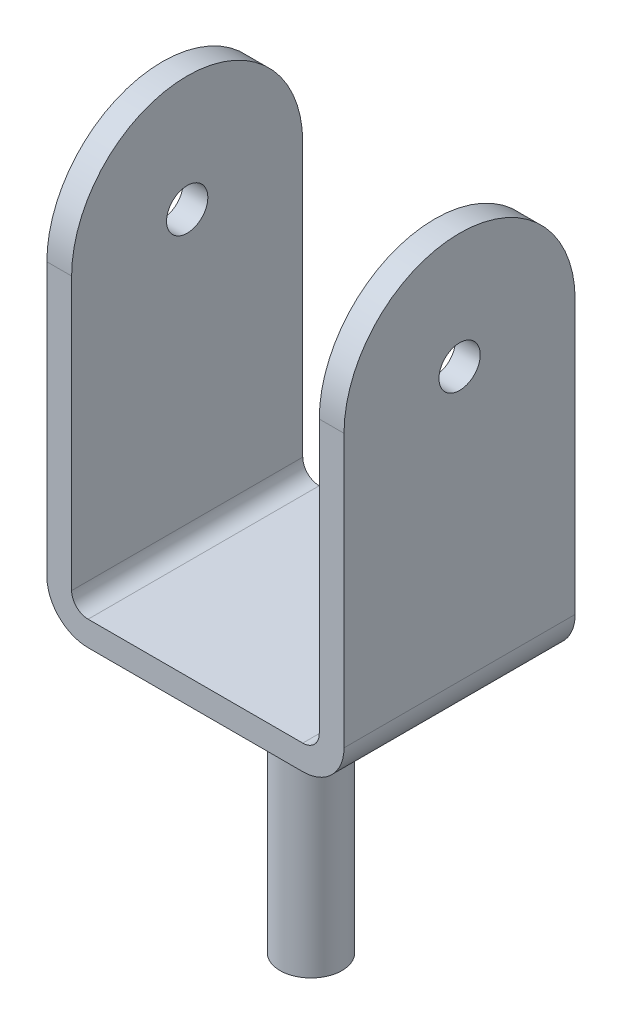
ISO-10303-21;
HEADER;
FILE_DESCRIPTION(('STEP AP214'),'2;1');
FILE_NAME('part.step','',(''),(''),'','','');
FILE_SCHEMA(('AUTOMOTIVE_DESIGN { 1 0 10303 214 1 1 1 1 }'));
ENDSEC;
DATA;
#1=APPLICATION_CONTEXT('core data for automotive mechanical design processes');
#2=APPLICATION_PROTOCOL_DEFINITION('international standard','automotive_design',2000,#1);
#3=PRODUCT_CONTEXT('',#1,'mechanical');
#4=PRODUCT('Part','Part','',(#3));
#5=PRODUCT_RELATED_PRODUCT_CATEGORY('part','',(#4));
#6=PRODUCT_DEFINITION_FORMATION('','',#4);
#7=PRODUCT_DEFINITION_CONTEXT('part definition',#1,'design');
#8=PRODUCT_DEFINITION('design','',#6,#7);
#9=PRODUCT_DEFINITION_SHAPE('','',#8);
#10=(LENGTH_UNIT() NAMED_UNIT(*) SI_UNIT(.MILLI.,.METRE.));
#11=(NAMED_UNIT(*) PLANE_ANGLE_UNIT() SI_UNIT($,.RADIAN.));
#12=(NAMED_UNIT(*) SI_UNIT($,.STERADIAN.) SOLID_ANGLE_UNIT());
#13=UNCERTAINTY_MEASURE_WITH_UNIT(LENGTH_MEASURE(1.E-05),#10,'distance_accuracy_value','');
#14=(GEOMETRIC_REPRESENTATION_CONTEXT(3) GLOBAL_UNCERTAINTY_ASSIGNED_CONTEXT((#13)) GLOBAL_UNIT_ASSIGNED_CONTEXT((#10,
#11,#12)) REPRESENTATION_CONTEXT('',''));
#15=CARTESIAN_POINT('',(0.,0.,0.));
#16=DIRECTION('',(0.,0.,1.));
#17=DIRECTION('',(1.,0.,0.));
#18=AXIS2_PLACEMENT_3D('',#15,#16,#17);
#19=CARTESIAN_POINT('',(-180.,50.,280.));
#20=DIRECTION('',(1.,0.,0.));
#21=DIRECTION('',(0.,1.,0.));
#22=AXIS2_PLACEMENT_3D('',#19,#20,#21);
#23=PLANE('',#22);
#24=CARTESIAN_POINT('',(-180.,380.,140.));
#25=DIRECTION('',(-1.,0.,0.));
#26=DIRECTION('',(0.,-1.,0.));
#27=AXIS2_PLACEMENT_3D('',#24,#25,#26);
#28=CIRCLE('',#27,140.);
#29=CARTESIAN_POINT('',(-180.,380.,0.));
#30=VERTEX_POINT('',#29);
#31=CARTESIAN_POINT('',(-180.,380.,280.));
#32=VERTEX_POINT('',#31);
#33=EDGE_CURVE('E108',#30,#32,#28,.F.);
#34=ORIENTED_EDGE('',*,*,#33,.F.);
#35=DIRECTION('',(0.,-1.,0.));
#36=VECTOR('',#35,1.);
#37=CARTESIAN_POINT('',(-180.,50.,0.));
#38=LINE('',#37,#36);
#39=CARTESIAN_POINT('',(-180.,50.,0.));
#40=VERTEX_POINT('',#39);
#41=EDGE_CURVE('E184',#30,#40,#38,.T.);
#42=ORIENTED_EDGE('',*,*,#41,.T.);
#43=DIRECTION('',(0.,0.,-1.));
#44=VECTOR('',#43,1.);
#45=CARTESIAN_POINT('',(-180.,50.,280.));
#46=LINE('',#45,#44);
#47=CARTESIAN_POINT('',(-180.,50.,280.));
#48=VERTEX_POINT('',#47);
#49=EDGE_CURVE('E255',#48,#40,#46,.T.);
#50=ORIENTED_EDGE('',*,*,#49,.F.);
#51=DIRECTION('',(0.,-1.,0.));
#52=VECTOR('',#51,1.);
#53=CARTESIAN_POINT('',(-180.,50.,280.));
#54=LINE('',#53,#52);
#55=EDGE_CURVE('E186',#32,#48,#54,.T.);
#56=ORIENTED_EDGE('',*,*,#55,.F.);
#57=EDGE_LOOP('',(#34,#42,#50,#56));
#58=FACE_BOUND('',#57,.T.);
#59=CARTESIAN_POINT('',(-180.,380.,140.));
#60=DIRECTION('',(1.,0.,0.));
#61=DIRECTION('',(0.,1.,0.));
#62=AXIS2_PLACEMENT_3D('',#59,#60,#61);
#63=CIRCLE('',#62,25.);
#64=CARTESIAN_POINT('',(-180.,405.,140.));
#65=VERTEX_POINT('',#64);
#66=EDGE_CURVE('E217',#65,#65,#63,.F.);
#67=ORIENTED_EDGE('',*,*,#66,.F.);
#68=EDGE_LOOP('',(#67));
#69=FACE_BOUND('',#68,.T.);
#70=ADVANCED_FACE('F91',(#58,#69),#23,.F.);
#71=CARTESIAN_POINT('',(180.,50.,280.));
#72=DIRECTION('',(-1.,0.,0.));
#73=DIRECTION('',(0.,-1.,0.));
#74=AXIS2_PLACEMENT_3D('',#71,#72,#73);
#75=PLANE('',#74);
#76=CARTESIAN_POINT('',(180.,380.,140.));
#77=DIRECTION('',(-1.,0.,0.));
#78=DIRECTION('',(0.,-1.,0.));
#79=AXIS2_PLACEMENT_3D('',#76,#77,#78);
#80=CIRCLE('',#79,25.);
#81=CARTESIAN_POINT('',(180.,355.,140.));
#82=VERTEX_POINT('',#81);
#83=EDGE_CURVE('E189',#82,#82,#80,.F.);
#84=ORIENTED_EDGE('',*,*,#83,.F.);
#85=EDGE_LOOP('',(#84));
#86=FACE_BOUND('',#85,.T.);
#87=DIRECTION('',(0.,1.,0.));
#88=VECTOR('',#87,1.);
#89=CARTESIAN_POINT('',(180.,50.,0.));
#90=LINE('',#89,#88);
#91=CARTESIAN_POINT('',(180.,50.,0.));
#92=VERTEX_POINT('',#91);
#93=CARTESIAN_POINT('',(180.,380.,0.));
#94=VERTEX_POINT('',#93);
#95=EDGE_CURVE('E269',#92,#94,#90,.T.);
#96=ORIENTED_EDGE('',*,*,#95,.T.);
#97=CARTESIAN_POINT('',(180.,380.,140.));
#98=DIRECTION('',(-1.,0.,0.));
#99=DIRECTION('',(0.,-1.,0.));
#100=AXIS2_PLACEMENT_3D('',#97,#98,#99);
#101=CIRCLE('',#100,140.);
#102=CARTESIAN_POINT('',(180.,380.,280.));
#103=VERTEX_POINT('',#102);
#104=EDGE_CURVE('E177',#94,#103,#101,.F.);
#105=ORIENTED_EDGE('',*,*,#104,.T.);
#106=DIRECTION('',(0.,1.,0.));
#107=VECTOR('',#106,1.);
#108=CARTESIAN_POINT('',(180.,50.,280.));
#109=LINE('',#108,#107);
#110=CARTESIAN_POINT('',(180.,50.,280.));
#111=VERTEX_POINT('',#110);
#112=EDGE_CURVE('E299',#111,#103,#109,.T.);
#113=ORIENTED_EDGE('',*,*,#112,.F.);
#114=DIRECTION('',(0.,0.,-1.));
#115=VECTOR('',#114,1.);
#116=CARTESIAN_POINT('',(180.,50.,280.));
#117=LINE('',#116,#115);
#118=EDGE_CURVE('E236',#111,#92,#117,.T.);
#119=ORIENTED_EDGE('',*,*,#118,.T.);
#120=EDGE_LOOP('',(#96,#105,#113,#119));
#121=FACE_BOUND('',#120,.T.);
#122=ADVANCED_FACE('F350',(#86,#121),#75,.F.);
#123=CARTESIAN_POINT('',(150.,520.,280.));
#124=DIRECTION('',(1.,0.,0.));
#125=DIRECTION('',(0.,1.,0.));
#126=AXIS2_PLACEMENT_3D('',#123,#124,#125);
#127=PLANE('',#126);
#128=CARTESIAN_POINT('',(150.,380.,140.));
#129=DIRECTION('',(1.,0.,0.));
#130=DIRECTION('',(0.,1.,0.));
#131=AXIS2_PLACEMENT_3D('',#128,#129,#130);
#132=CIRCLE('',#131,25.);
#133=CARTESIAN_POINT('',(150.,405.,140.));
#134=VERTEX_POINT('',#133);
#135=EDGE_CURVE('E318',#134,#134,#132,.F.);
#136=ORIENTED_EDGE('',*,*,#135,.F.);
#137=EDGE_LOOP('',(#136));
#138=FACE_BOUND('',#137,.T.);
#139=CARTESIAN_POINT('',(150.,380.,140.));
#140=DIRECTION('',(1.,0.,0.));
#141=DIRECTION('',(0.,1.,0.));
#142=AXIS2_PLACEMENT_3D('',#139,#140,#141);
#143=CIRCLE('',#142,140.);
#144=CARTESIAN_POINT('',(150.,380.,280.));
#145=VERTEX_POINT('',#144);
#146=CARTESIAN_POINT('',(150.,380.,0.));
#147=VERTEX_POINT('',#146);
#148=EDGE_CURVE('E310',#145,#147,#143,.F.);
#149=ORIENTED_EDGE('',*,*,#148,.T.);
#150=DIRECTION('',(0.,-1.,0.));
#151=VECTOR('',#150,1.);
#152=CARTESIAN_POINT('',(150.,520.,0.));
#153=LINE('',#152,#151);
#154=CARTESIAN_POINT('',(150.,50.,0.));
#155=VERTEX_POINT('',#154);
#156=EDGE_CURVE('E266',#147,#155,#153,.T.);
#157=ORIENTED_EDGE('',*,*,#156,.T.);
#158=DIRECTION('',(0.,0.,-1.));
#159=VECTOR('',#158,1.);
#160=CARTESIAN_POINT('',(150.,50.,280.));
#161=LINE('',#160,#159);
#162=CARTESIAN_POINT('',(150.,50.,280.));
#163=VERTEX_POINT('',#162);
#164=EDGE_CURVE('E240',#163,#155,#161,.T.);
#165=ORIENTED_EDGE('',*,*,#164,.F.);
#166=DIRECTION('',(0.,-1.,0.));
#167=VECTOR('',#166,1.);
#168=CARTESIAN_POINT('',(150.,520.,280.));
#169=LINE('',#168,#167);
#170=EDGE_CURVE('E296',#145,#163,#169,.T.);
#171=ORIENTED_EDGE('',*,*,#170,.F.);
#172=EDGE_LOOP('',(#149,#157,#165,#171));
#173=FACE_BOUND('',#172,.T.);
#174=ADVANCED_FACE('F366',(#138,#173),#127,.F.);
#175=CARTESIAN_POINT('',(-150.,520.,280.));
#176=DIRECTION('',(-1.,0.,0.));
#177=DIRECTION('',(0.,-1.,0.));
#178=AXIS2_PLACEMENT_3D('',#175,#176,#177);
#179=PLANE('',#178);
#180=CARTESIAN_POINT('',(-150.,380.,140.));
#181=DIRECTION('',(-1.,0.,0.));
#182=DIRECTION('',(0.,-1.,0.));
#183=AXIS2_PLACEMENT_3D('',#180,#181,#182);
#184=CIRCLE('',#183,25.);
#185=CARTESIAN_POINT('',(-150.,355.,140.));
#186=VERTEX_POINT('',#185);
#187=EDGE_CURVE('E220',#186,#186,#184,.F.);
#188=ORIENTED_EDGE('',*,*,#187,.F.);
#189=EDGE_LOOP('',(#188));
#190=FACE_BOUND('',#189,.T.);
#191=DIRECTION('',(0.,1.,0.));
#192=VECTOR('',#191,1.);
#193=CARTESIAN_POINT('',(-150.,520.,0.));
#194=LINE('',#193,#192);
#195=CARTESIAN_POINT('',(-150.,50.,0.));
#196=VERTEX_POINT('',#195);
#197=CARTESIAN_POINT('',(-150.,380.,0.));
#198=VERTEX_POINT('',#197);
#199=EDGE_CURVE('E205',#196,#198,#194,.T.);
#200=ORIENTED_EDGE('',*,*,#199,.T.);
#201=CARTESIAN_POINT('',(-150.,380.,140.));
#202=DIRECTION('',(-1.,0.,0.));
#203=DIRECTION('',(0.,-1.,0.));
#204=AXIS2_PLACEMENT_3D('',#201,#202,#203);
#205=CIRCLE('',#204,140.);
#206=CARTESIAN_POINT('',(-150.,380.,280.));
#207=VERTEX_POINT('',#206);
#208=EDGE_CURVE('E188',#198,#207,#205,.F.);
#209=ORIENTED_EDGE('',*,*,#208,.T.);
#210=DIRECTION('',(0.,1.,0.));
#211=VECTOR('',#210,1.);
#212=CARTESIAN_POINT('',(-150.,520.,280.));
#213=LINE('',#212,#211);
#214=CARTESIAN_POINT('',(-150.,50.,280.));
#215=VERTEX_POINT('',#214);
#216=EDGE_CURVE('E283',#215,#207,#213,.T.);
#217=ORIENTED_EDGE('',*,*,#216,.F.);
#218=DIRECTION('',(0.,0.,-1.));
#219=VECTOR('',#218,1.);
#220=CARTESIAN_POINT('',(-150.,50.,280.));
#221=LINE('',#220,#219);
#222=EDGE_CURVE('E251',#215,#196,#221,.T.);
#223=ORIENTED_EDGE('',*,*,#222,.T.);
#224=EDGE_LOOP('',(#200,#209,#217,#223));
#225=FACE_BOUND('',#224,.T.);
#226=ADVANCED_FACE('F371',(#190,#225),#179,.F.);
#227=CARTESIAN_POINT('',(-130.,50.,0.));
#228=DIRECTION('',(0.,0.,-1.));
#229=DIRECTION('',(-1.,0.,0.));
#230=AXIS2_PLACEMENT_3D('',#227,#228,#229);
#231=PLANE('',#230);
#232=ORIENTED_EDGE('',*,*,#41,.F.);
#233=DIRECTION('',(-1.,0.,0.));
#234=VECTOR('',#233,1.);
#235=CARTESIAN_POINT('',(219.,380.,0.));
#236=LINE('',#235,#234);
#237=EDGE_CURVE('E101',#30,#198,#236,.F.);
#238=ORIENTED_EDGE('',*,*,#237,.T.);
#239=ORIENTED_EDGE('',*,*,#199,.F.);
#240=CARTESIAN_POINT('',(-130.,50.,0.));
#241=DIRECTION('',(0.,0.,-1.));
#242=DIRECTION('',(1.,0.,0.));
#243=AXIS2_PLACEMENT_3D('',#240,#241,#242);
#244=CIRCLE('',#243,20.);
#245=CARTESIAN_POINT('',(-130.,30.,0.));
#246=VERTEX_POINT('',#245);
#247=EDGE_CURVE('E214',#246,#196,#244,.T.);
#248=ORIENTED_EDGE('',*,*,#247,.F.);
#249=DIRECTION('',(-1.,0.,0.));
#250=VECTOR('',#249,1.);
#251=CARTESIAN_POINT('',(-130.,30.,0.));
#252=LINE('',#251,#250);
#253=CARTESIAN_POINT('',(130.,30.,0.));
#254=VERTEX_POINT('',#253);
#255=EDGE_CURVE('E260',#254,#246,#252,.T.);
#256=ORIENTED_EDGE('',*,*,#255,.F.);
#257=CARTESIAN_POINT('',(130.,50.,0.));
#258=DIRECTION('',(0.,0.,-1.));
#259=DIRECTION('',(-1.,0.,0.));
#260=AXIS2_PLACEMENT_3D('',#257,#258,#259);
#261=CIRCLE('',#260,20.);
#262=EDGE_CURVE('E263',#155,#254,#261,.T.);
#263=ORIENTED_EDGE('',*,*,#262,.F.);
#264=ORIENTED_EDGE('',*,*,#156,.F.);
#265=EDGE_CURVE('E197',#147,#94,#236,.F.);
#266=ORIENTED_EDGE('',*,*,#265,.T.);
#267=ORIENTED_EDGE('',*,*,#95,.F.);
#268=CARTESIAN_POINT('',(130.,50.,0.));
#269=DIRECTION('',(0.,0.,1.));
#270=DIRECTION('',(1.,0.,0.));
#271=AXIS2_PLACEMENT_3D('',#268,#269,#270);
#272=CIRCLE('',#271,50.);
#273=CARTESIAN_POINT('',(130.,0.,0.));
#274=VERTEX_POINT('',#273);
#275=EDGE_CURVE('E273',#274,#92,#272,.T.);
#276=ORIENTED_EDGE('',*,*,#275,.F.);
#277=DIRECTION('',(1.,0.,0.));
#278=VECTOR('',#277,1.);
#279=CARTESIAN_POINT('',(-130.,0.,0.));
#280=LINE('',#279,#278);
#281=CARTESIAN_POINT('',(-130.,0.,0.));
#282=VERTEX_POINT('',#281);
#283=EDGE_CURVE('E276',#282,#274,#280,.T.);
#284=ORIENTED_EDGE('',*,*,#283,.F.);
#285=CARTESIAN_POINT('',(-130.,50.,0.));
#286=DIRECTION('',(0.,0.,1.));
#287=DIRECTION('',(-1.,0.,0.));
#288=AXIS2_PLACEMENT_3D('',#285,#286,#287);
#289=CIRCLE('',#288,50.);
#290=EDGE_CURVE('E202',#40,#282,#289,.T.);
#291=ORIENTED_EDGE('',*,*,#290,.F.);
#292=EDGE_LOOP('',(#232,#238,#239,#248,#256,#263,#264,#266,#267,#276,#284,#291));
#293=FACE_BOUND('',#292,.T.);
#294=ADVANCED_FACE('F200',(#293),#231,.T.);
#295=CARTESIAN_POINT('',(-130.,50.,280.));
#296=DIRECTION('',(0.,0.,-1.));
#297=DIRECTION('',(-1.,0.,0.));
#298=AXIS2_PLACEMENT_3D('',#295,#296,#297);
#299=PLANE('',#298);
#300=DIRECTION('',(-1.,0.,0.));
#301=VECTOR('',#300,1.);
#302=CARTESIAN_POINT('',(219.,380.,280.));
#303=LINE('',#302,#301);
#304=EDGE_CURVE('E224',#32,#207,#303,.F.);
#305=ORIENTED_EDGE('',*,*,#304,.F.);
#306=ORIENTED_EDGE('',*,*,#55,.T.);
#307=CARTESIAN_POINT('',(-130.,50.,280.));
#308=DIRECTION('',(0.,0.,1.));
#309=DIRECTION('',(-1.,0.,0.));
#310=AXIS2_PLACEMENT_3D('',#307,#308,#309);
#311=CIRCLE('',#310,50.);
#312=CARTESIAN_POINT('',(-130.,0.,280.));
#313=VERTEX_POINT('',#312);
#314=EDGE_CURVE('E204',#48,#313,#311,.T.);
#315=ORIENTED_EDGE('',*,*,#314,.T.);
#316=DIRECTION('',(1.,0.,0.));
#317=VECTOR('',#316,1.);
#318=CARTESIAN_POINT('',(-130.,0.,280.));
#319=LINE('',#318,#317);
#320=CARTESIAN_POINT('',(130.,0.,280.));
#321=VERTEX_POINT('',#320);
#322=EDGE_CURVE('E211',#313,#321,#319,.T.);
#323=ORIENTED_EDGE('',*,*,#322,.T.);
#324=CARTESIAN_POINT('',(130.,50.,280.));
#325=DIRECTION('',(0.,0.,1.));
#326=DIRECTION('',(1.,0.,0.));
#327=AXIS2_PLACEMENT_3D('',#324,#325,#326);
#328=CIRCLE('',#327,50.);
#329=EDGE_CURVE('E303',#321,#111,#328,.T.);
#330=ORIENTED_EDGE('',*,*,#329,.T.);
#331=ORIENTED_EDGE('',*,*,#112,.T.);
#332=EDGE_CURVE('E225',#145,#103,#303,.F.);
#333=ORIENTED_EDGE('',*,*,#332,.F.);
#334=ORIENTED_EDGE('',*,*,#170,.T.);
#335=CARTESIAN_POINT('',(130.,50.,280.));
#336=DIRECTION('',(0.,0.,-1.));
#337=DIRECTION('',(-1.,0.,0.));
#338=AXIS2_PLACEMENT_3D('',#335,#336,#337);
#339=CIRCLE('',#338,20.);
#340=CARTESIAN_POINT('',(130.,30.,280.));
#341=VERTEX_POINT('',#340);
#342=EDGE_CURVE('E293',#163,#341,#339,.T.);
#343=ORIENTED_EDGE('',*,*,#342,.T.);
#344=DIRECTION('',(-1.,0.,0.));
#345=VECTOR('',#344,1.);
#346=CARTESIAN_POINT('',(-130.,30.,280.));
#347=LINE('',#346,#345);
#348=CARTESIAN_POINT('',(-130.,30.,280.));
#349=VERTEX_POINT('',#348);
#350=EDGE_CURVE('E290',#341,#349,#347,.T.);
#351=ORIENTED_EDGE('',*,*,#350,.T.);
#352=CARTESIAN_POINT('',(-130.,50.,280.));
#353=DIRECTION('',(0.,0.,-1.));
#354=DIRECTION('',(1.,0.,0.));
#355=AXIS2_PLACEMENT_3D('',#352,#353,#354);
#356=CIRCLE('',#355,20.);
#357=EDGE_CURVE('E287',#349,#215,#356,.T.);
#358=ORIENTED_EDGE('',*,*,#357,.T.);
#359=ORIENTED_EDGE('',*,*,#216,.T.);
#360=EDGE_LOOP('',(#305,#306,#315,#323,#330,#331,#333,#334,#343,#351,#358,#359));
#361=FACE_BOUND('',#360,.T.);
#362=ADVANCED_FACE('F354',(#361),#299,.F.);
#363=CARTESIAN_POINT('',(-130.,50.,280.));
#364=DIRECTION('',(0.,0.,-1.));
#365=DIRECTION('',(-1.,0.,0.));
#366=AXIS2_PLACEMENT_3D('',#363,#364,#365);
#367=CYLINDRICAL_SURFACE('',#366,50.);
#368=ORIENTED_EDGE('',*,*,#290,.T.);
#369=DIRECTION('',(0.,0.,-1.));
#370=VECTOR('',#369,1.);
#371=CARTESIAN_POINT('',(-130.,0.,280.));
#372=LINE('',#371,#370);
#373=EDGE_CURVE('E228',#313,#282,#372,.T.);
#374=ORIENTED_EDGE('',*,*,#373,.F.);
#375=ORIENTED_EDGE('',*,*,#314,.F.);
#376=ORIENTED_EDGE('',*,*,#49,.T.);
#377=EDGE_LOOP('',(#368,#374,#375,#376));
#378=FACE_BOUND('',#377,.T.);
#379=ADVANCED_FACE('F93',(#378),#367,.T.);
#380=CARTESIAN_POINT('',(-130.,0.,280.));
#381=DIRECTION('',(0.,1.,0.));
#382=DIRECTION('',(0.,0.,1.));
#383=AXIS2_PLACEMENT_3D('',#380,#381,#382);
#384=PLANE('',#383);
#385=CARTESIAN_POINT('',(0.,0.,140.));
#386=DIRECTION('',(0.,1.,0.));
#387=DIRECTION('',(0.,0.,1.));
#388=AXIS2_PLACEMENT_3D('',#385,#386,#387);
#389=CIRCLE('',#388,37.5);
#390=CARTESIAN_POINT('',(0.,0.,177.5));
#391=VERTEX_POINT('',#390);
#392=EDGE_CURVE('E12',#391,#391,#389,.F.);
#393=ORIENTED_EDGE('',*,*,#392,.F.);
#394=EDGE_LOOP('',(#393));
#395=FACE_BOUND('',#394,.T.);
#396=ORIENTED_EDGE('',*,*,#283,.T.);
#397=DIRECTION('',(0.,0.,-1.));
#398=VECTOR('',#397,1.);
#399=CARTESIAN_POINT('',(130.,0.,280.));
#400=LINE('',#399,#398);
#401=EDGE_CURVE('E232',#321,#274,#400,.T.);
#402=ORIENTED_EDGE('',*,*,#401,.F.);
#403=ORIENTED_EDGE('',*,*,#322,.F.);
#404=ORIENTED_EDGE('',*,*,#373,.T.);
#405=EDGE_LOOP('',(#396,#402,#403,#404));
#406=FACE_BOUND('',#405,.T.);
#407=ADVANCED_FACE('F337',(#395,#406),#384,.F.);
#408=CARTESIAN_POINT('',(130.,50.,280.));
#409=DIRECTION('',(0.,0.,-1.));
#410=DIRECTION('',(-1.,0.,0.));
#411=AXIS2_PLACEMENT_3D('',#408,#409,#410);
#412=CYLINDRICAL_SURFACE('',#411,50.);
#413=ORIENTED_EDGE('',*,*,#275,.T.);
#414=ORIENTED_EDGE('',*,*,#118,.F.);
#415=ORIENTED_EDGE('',*,*,#329,.F.);
#416=ORIENTED_EDGE('',*,*,#401,.T.);
#417=EDGE_LOOP('',(#413,#414,#415,#416));
#418=FACE_BOUND('',#417,.T.);
#419=ADVANCED_FACE('F340',(#418),#412,.T.);
#420=CARTESIAN_POINT('',(130.,50.,280.));
#421=DIRECTION('',(0.,0.,-1.));
#422=DIRECTION('',(-1.,0.,0.));
#423=AXIS2_PLACEMENT_3D('',#420,#421,#422);
#424=CYLINDRICAL_SURFACE('',#423,20.);
#425=ORIENTED_EDGE('',*,*,#262,.T.);
#426=DIRECTION('',(0.,0.,-1.));
#427=VECTOR('',#426,1.);
#428=CARTESIAN_POINT('',(130.,30.,280.));
#429=LINE('',#428,#427);
#430=EDGE_CURVE('E244',#341,#254,#429,.T.);
#431=ORIENTED_EDGE('',*,*,#430,.F.);
#432=ORIENTED_EDGE('',*,*,#342,.F.);
#433=ORIENTED_EDGE('',*,*,#164,.T.);
#434=EDGE_LOOP('',(#425,#431,#432,#433));
#435=FACE_BOUND('',#434,.T.);
#436=ADVANCED_FACE('F383',(#435),#424,.F.);
#437=CARTESIAN_POINT('',(-130.,30.,280.));
#438=DIRECTION('',(0.,-1.,0.));
#439=DIRECTION('',(0.,0.,-1.));
#440=AXIS2_PLACEMENT_3D('',#437,#438,#439);
#441=PLANE('',#440);
#442=ORIENTED_EDGE('',*,*,#255,.T.);
#443=DIRECTION('',(0.,0.,-1.));
#444=VECTOR('',#443,1.);
#445=CARTESIAN_POINT('',(-130.,30.,280.));
#446=LINE('',#445,#444);
#447=EDGE_CURVE('E247',#349,#246,#446,.T.);
#448=ORIENTED_EDGE('',*,*,#447,.F.);
#449=ORIENTED_EDGE('',*,*,#350,.F.);
#450=ORIENTED_EDGE('',*,*,#430,.T.);
#451=EDGE_LOOP('',(#442,#448,#449,#450));
#452=FACE_BOUND('',#451,.T.);
#453=ADVANCED_FACE('F379',(#452),#441,.F.);
#454=CARTESIAN_POINT('',(-130.,50.,280.));
#455=DIRECTION('',(0.,0.,-1.));
#456=DIRECTION('',(-1.,0.,0.));
#457=AXIS2_PLACEMENT_3D('',#454,#455,#456);
#458=CYLINDRICAL_SURFACE('',#457,20.);
#459=ORIENTED_EDGE('',*,*,#247,.T.);
#460=ORIENTED_EDGE('',*,*,#222,.F.);
#461=ORIENTED_EDGE('',*,*,#357,.F.);
#462=ORIENTED_EDGE('',*,*,#447,.T.);
#463=EDGE_LOOP('',(#459,#460,#461,#462));
#464=FACE_BOUND('',#463,.T.);
#465=ADVANCED_FACE('F375',(#464),#458,.F.);
#466=CARTESIAN_POINT('',(219.,380.,140.));
#467=DIRECTION('',(-1.,0.,0.));
#468=DIRECTION('',(0.,-1.,0.));
#469=AXIS2_PLACEMENT_3D('',#466,#467,#468);
#470=CYLINDRICAL_SURFACE('',#469,140.);
#471=ORIENTED_EDGE('',*,*,#104,.F.);
#472=ORIENTED_EDGE('',*,*,#265,.F.);
#473=ORIENTED_EDGE('',*,*,#148,.F.);
#474=ORIENTED_EDGE('',*,*,#332,.T.);
#475=EDGE_LOOP('',(#471,#472,#473,#474));
#476=FACE_BOUND('',#475,.T.);
#477=ADVANCED_FACE('F378',(#476),#470,.T.);
#478=ORIENTED_EDGE('',*,*,#208,.F.);
#479=ORIENTED_EDGE('',*,*,#237,.F.);
#480=ORIENTED_EDGE('',*,*,#33,.T.);
#481=ORIENTED_EDGE('',*,*,#304,.T.);
#482=EDGE_LOOP('',(#478,#479,#480,#481));
#483=FACE_BOUND('',#482,.T.);
#484=ADVANCED_FACE('F191',(#483),#470,.T.);
#485=CARTESIAN_POINT('',(-180.000012,380.,140.));
#486=DIRECTION('',(1.,0.,0.));
#487=DIRECTION('',(0.,1.,0.));
#488=AXIS2_PLACEMENT_3D('',#485,#486,#487);
#489=CYLINDRICAL_SURFACE('',#488,25.);
#490=ORIENTED_EDGE('',*,*,#66,.T.);
#491=EDGE_LOOP('',(#490));
#492=FACE_BOUND('',#491,.T.);
#493=ORIENTED_EDGE('',*,*,#187,.T.);
#494=EDGE_LOOP('',(#493));
#495=FACE_BOUND('',#494,.T.);
#496=ADVANCED_FACE('F414',(#492,#495),#489,.F.);
#497=ORIENTED_EDGE('',*,*,#135,.T.);
#498=EDGE_LOOP('',(#497));
#499=FACE_BOUND('',#498,.T.);
#500=ORIENTED_EDGE('',*,*,#83,.T.);
#501=EDGE_LOOP('',(#500));
#502=FACE_BOUND('',#501,.T.);
#503=ADVANCED_FACE('F333',(#499,#502),#489,.F.);
#504=CARTESIAN_POINT('',(0.,-325.,140.));
#505=DIRECTION('',(0.,1.,0.));
#506=DIRECTION('',(0.,0.,1.));
#507=AXIS2_PLACEMENT_3D('',#504,#505,#506);
#508=CYLINDRICAL_SURFACE('',#507,37.5);
#509=CARTESIAN_POINT('',(0.,-325.,140.));
#510=DIRECTION('',(0.,-1.,0.));
#511=DIRECTION('',(0.,0.,-1.));
#512=AXIS2_PLACEMENT_3D('',#509,#510,#511);
#513=CIRCLE('',#512,37.5);
#514=CARTESIAN_POINT('',(0.,-325.,102.5));
#515=VERTEX_POINT('',#514);
#516=EDGE_CURVE('E221',#515,#515,#513,.T.);
#517=ORIENTED_EDGE('',*,*,#516,.F.);
#518=EDGE_LOOP('',(#517));
#519=FACE_BOUND('',#518,.T.);
#520=ORIENTED_EDGE('',*,*,#392,.T.);
#521=EDGE_LOOP('',(#520));
#522=FACE_BOUND('',#521,.T.);
#523=ADVANCED_FACE('F330',(#519,#522),#508,.T.);
#524=CARTESIAN_POINT('',(0.,-325.,140.));
#525=DIRECTION('',(0.,-1.,0.));
#526=DIRECTION('',(0.,0.,-1.));
#527=AXIS2_PLACEMENT_3D('',#524,#525,#526);
#528=PLANE('',#527);
#529=ORIENTED_EDGE('',*,*,#516,.T.);
#530=EDGE_LOOP('',(#529));
#531=FACE_BOUND('',#530,.T.);
#532=ADVANCED_FACE('F328',(#531),#528,.T.);
#533=CLOSED_SHELL('',(#70,#122,#174,#226,#294,#362,#379,#407,#419,#436,#453,#465,#477,#484,#496,
#503,#523,#532));
#534=MANIFOLD_SOLID_BREP('B2',#533);
#535=ADVANCED_BREP_SHAPE_REPRESENTATION('',(#18,#534),#14);
#536=SHAPE_DEFINITION_REPRESENTATION(#9,#535);
ENDSEC;
END-ISO-10303-21;
